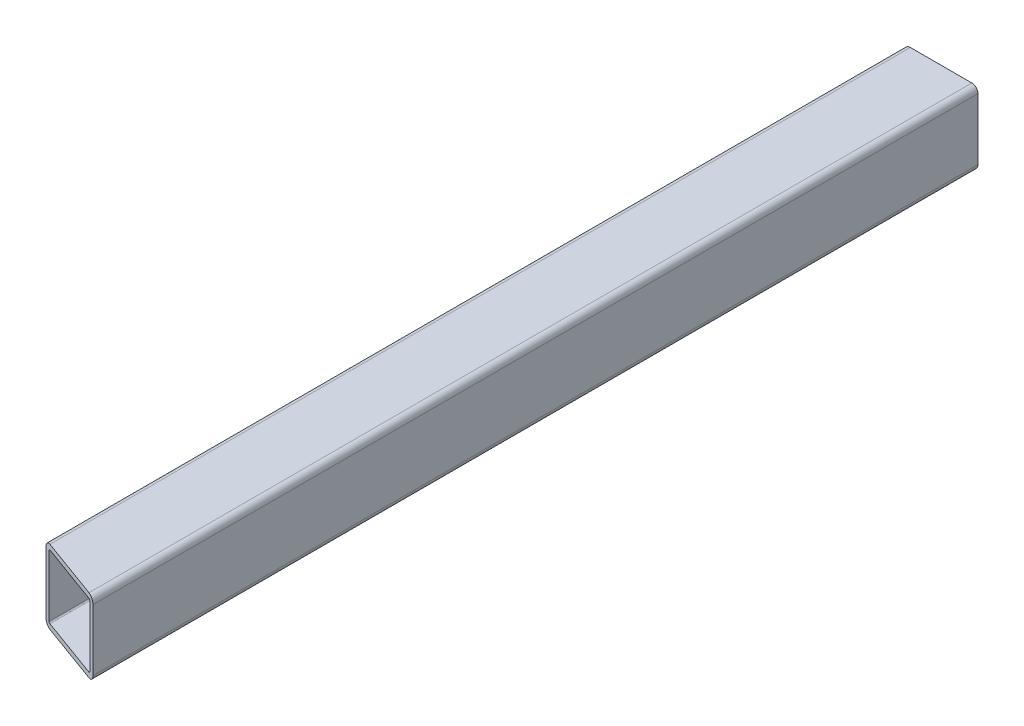
ISO-10303-21;
HEADER;
FILE_DESCRIPTION(('STEP AP214'),'2;1');
FILE_NAME('part.step','',(''),(''),'','','');
FILE_SCHEMA(('AUTOMOTIVE_DESIGN { 1 0 10303 214 1 1 1 1 }'));
ENDSEC;
DATA;
#1=APPLICATION_CONTEXT('core data for automotive mechanical design processes');
#2=APPLICATION_PROTOCOL_DEFINITION('international standard','automotive_design',2000,#1);
#3=PRODUCT_CONTEXT('',#1,'mechanical');
#4=PRODUCT('Part','Part','',(#3));
#5=PRODUCT_RELATED_PRODUCT_CATEGORY('part','',(#4));
#6=PRODUCT_DEFINITION_FORMATION('','',#4);
#7=PRODUCT_DEFINITION_CONTEXT('part definition',#1,'design');
#8=PRODUCT_DEFINITION('design','',#6,#7);
#9=PRODUCT_DEFINITION_SHAPE('','',#8);
#10=(LENGTH_UNIT() NAMED_UNIT(*) SI_UNIT(.MILLI.,.METRE.));
#11=(NAMED_UNIT(*) PLANE_ANGLE_UNIT() SI_UNIT($,.RADIAN.));
#12=(NAMED_UNIT(*) SI_UNIT($,.STERADIAN.) SOLID_ANGLE_UNIT());
#13=UNCERTAINTY_MEASURE_WITH_UNIT(LENGTH_MEASURE(1.E-05),#10,'distance_accuracy_value','');
#14=(GEOMETRIC_REPRESENTATION_CONTEXT(3) GLOBAL_UNCERTAINTY_ASSIGNED_CONTEXT((#13)) GLOBAL_UNIT_ASSIGNED_CONTEXT((#10,
#11,#12)) REPRESENTATION_CONTEXT('',''));
#15=CARTESIAN_POINT('',(0.,0.,0.));
#16=DIRECTION('',(0.,0.,1.));
#17=DIRECTION('',(1.,0.,0.));
#18=AXIS2_PLACEMENT_3D('',#15,#16,#17);
#19=CARTESIAN_POINT('',(-15.875,-15.875,228.6));
#20=DIRECTION('',(0.,0.,-1.));
#21=DIRECTION('',(-1.,0.,0.));
#22=AXIS2_PLACEMENT_3D('',#19,#20,#21);
#23=CYLINDRICAL_SURFACE('',#22,3.175);
#24=CARTESIAN_POINT('',(-15.875,-15.875,215.888339568253));
#25=DIRECTION('',(-0.34202014332567,0.,0.939692620785908));
#26=DIRECTION('',(-0.939692620785908,0.,-0.34202014332567));
#27=AXIS2_PLACEMENT_3D('',#24,#25,#26);
#28=ELLIPSE('',#27,3.37876442761102,3.175);
#29=CARTESIAN_POINT('',(-19.05,-15.875,214.732734074458));
#30=VERTEX_POINT('',#29);
#31=CARTESIAN_POINT('',(-15.875,-19.05,215.888339568253));
#32=VERTEX_POINT('',#31);
#33=EDGE_CURVE('E206',#30,#32,#28,.T.);
#34=ORIENTED_EDGE('',*,*,#33,.F.);
#35=DIRECTION('',(0.,0.,-1.));
#36=VECTOR('',#35,1.);
#37=CARTESIAN_POINT('',(-19.05,-15.875,228.6));
#38=LINE('',#37,#36);
#39=CARTESIAN_POINT('',(-19.05,-15.875,-228.6));
#40=VERTEX_POINT('',#39);
#41=EDGE_CURVE('E191',#30,#40,#38,.T.);
#42=ORIENTED_EDGE('',*,*,#41,.T.);
#43=CARTESIAN_POINT('',(-15.875,-15.875,-228.6));
#44=DIRECTION('',(0.,0.,1.));
#45=DIRECTION('',(1.,0.,0.));
#46=AXIS2_PLACEMENT_3D('',#43,#44,#45);
#47=CIRCLE('',#46,3.175);
#48=CARTESIAN_POINT('',(-15.875,-19.05,-228.6));
#49=VERTEX_POINT('',#48);
#50=EDGE_CURVE('E284',#40,#49,#47,.T.);
#51=ORIENTED_EDGE('',*,*,#50,.T.);
#52=DIRECTION('',(0.,0.,-1.));
#53=VECTOR('',#52,1.);
#54=CARTESIAN_POINT('',(-15.875,-19.05,228.6));
#55=LINE('',#54,#53);
#56=EDGE_CURVE('E87',#32,#49,#55,.T.);
#57=ORIENTED_EDGE('',*,*,#56,.F.);
#58=EDGE_LOOP('',(#34,#42,#51,#57));
#59=FACE_BOUND('',#58,.T.);
#60=ADVANCED_FACE('F80',(#59),#23,.T.);
#61=CARTESIAN_POINT('',(-15.875,-19.05,228.6));
#62=DIRECTION('',(0.,1.,0.));
#63=DIRECTION('',(0.,0.,1.));
#64=AXIS2_PLACEMENT_3D('',#61,#62,#63);
#65=PLANE('',#64);
#66=DIRECTION('',(0.939692620785908,0.,0.34202014332567));
#67=VECTOR('',#66,1.);
#68=CARTESIAN_POINT('',(-11.7895510879651,-19.05,217.375321365849));
#69=LINE('',#68,#67);
#70=CARTESIAN_POINT('',(15.875,-19.05,227.444394506205));
#71=VERTEX_POINT('',#70);
#72=EDGE_CURVE('E94',#32,#71,#69,.T.);
#73=ORIENTED_EDGE('',*,*,#72,.F.);
#74=ORIENTED_EDGE('',*,*,#56,.T.);
#75=DIRECTION('',(1.,0.,0.));
#76=VECTOR('',#75,1.);
#77=CARTESIAN_POINT('',(-15.875,-19.05,-228.6));
#78=LINE('',#77,#76);
#79=CARTESIAN_POINT('',(15.875,-19.05,-228.6));
#80=VERTEX_POINT('',#79);
#81=EDGE_CURVE('E288',#49,#80,#78,.T.);
#82=ORIENTED_EDGE('',*,*,#81,.T.);
#83=DIRECTION('',(0.,0.,-1.));
#84=VECTOR('',#83,1.);
#85=CARTESIAN_POINT('',(15.875,-19.05,228.6));
#86=LINE('',#85,#84);
#87=EDGE_CURVE('E316',#71,#80,#86,.T.);
#88=ORIENTED_EDGE('',*,*,#87,.F.);
#89=EDGE_LOOP('',(#73,#74,#82,#88));
#90=FACE_BOUND('',#89,.T.);
#91=ADVANCED_FACE('F318',(#90),#65,.F.);
#92=CARTESIAN_POINT('',(15.875,-15.875,228.6));
#93=DIRECTION('',(0.,0.,-1.));
#94=DIRECTION('',(-1.,0.,0.));
#95=AXIS2_PLACEMENT_3D('',#92,#93,#94);
#96=CYLINDRICAL_SURFACE('',#95,3.175);
#97=CARTESIAN_POINT('',(15.875,-15.875,227.444394506205));
#98=DIRECTION('',(-0.34202014332567,0.,0.939692620785908));
#99=DIRECTION('',(-0.939692620785908,0.,-0.34202014332567));
#100=AXIS2_PLACEMENT_3D('',#97,#98,#99);
#101=ELLIPSE('',#100,3.37876442761102,3.175);
#102=CARTESIAN_POINT('',(19.05,-15.875,228.6));
#103=VERTEX_POINT('',#102);
#104=EDGE_CURVE('E102',#71,#103,#101,.T.);
#105=ORIENTED_EDGE('',*,*,#104,.F.);
#106=ORIENTED_EDGE('',*,*,#87,.T.);
#107=CARTESIAN_POINT('',(15.875,-15.875,-228.6));
#108=DIRECTION('',(0.,0.,1.));
#109=DIRECTION('',(1.,0.,0.));
#110=AXIS2_PLACEMENT_3D('',#107,#108,#109);
#111=CIRCLE('',#110,3.175);
#112=CARTESIAN_POINT('',(19.05,-15.875,-228.6));
#113=VERTEX_POINT('',#112);
#114=EDGE_CURVE('E291',#80,#113,#111,.T.);
#115=ORIENTED_EDGE('',*,*,#114,.T.);
#116=DIRECTION('',(0.,0.,-1.));
#117=VECTOR('',#116,1.);
#118=CARTESIAN_POINT('',(19.05,-15.875,228.6));
#119=LINE('',#118,#117);
#120=EDGE_CURVE('E313',#103,#113,#119,.T.);
#121=ORIENTED_EDGE('',*,*,#120,.F.);
#122=EDGE_LOOP('',(#105,#106,#115,#121));
#123=FACE_BOUND('',#122,.T.);
#124=ADVANCED_FACE('F325',(#123),#96,.T.);
#125=CARTESIAN_POINT('',(15.875,15.875,228.6));
#126=DIRECTION('',(0.,0.,-1.));
#127=DIRECTION('',(-1.,0.,0.));
#128=AXIS2_PLACEMENT_3D('',#125,#126,#127);
#129=CYLINDRICAL_SURFACE('',#128,3.175);
#130=CARTESIAN_POINT('',(15.875,15.875,227.444394506205));
#131=DIRECTION('',(-0.34202014332567,0.,0.939692620785908));
#132=DIRECTION('',(-0.939692620785908,0.,-0.34202014332567));
#133=AXIS2_PLACEMENT_3D('',#130,#131,#132);
#134=ELLIPSE('',#133,3.37876442761103,3.175);
#135=CARTESIAN_POINT('',(19.05,15.875,228.6));
#136=VERTEX_POINT('',#135);
#137=CARTESIAN_POINT('',(15.875,19.05,227.444394506205));
#138=VERTEX_POINT('',#137);
#139=EDGE_CURVE('E240',#136,#138,#134,.T.);
#140=ORIENTED_EDGE('',*,*,#139,.F.);
#141=DIRECTION('',(0.,0.,-1.));
#142=VECTOR('',#141,1.);
#143=CARTESIAN_POINT('',(19.05,15.875,228.6));
#144=LINE('',#143,#142);
#145=CARTESIAN_POINT('',(19.05,15.875,-228.6));
#146=VERTEX_POINT('',#145);
#147=EDGE_CURVE('E310',#136,#146,#144,.T.);
#148=ORIENTED_EDGE('',*,*,#147,.T.);
#149=CARTESIAN_POINT('',(15.875,15.875,-228.6));
#150=DIRECTION('',(0.,0.,1.));
#151=DIRECTION('',(1.,0.,0.));
#152=AXIS2_PLACEMENT_3D('',#149,#150,#151);
#153=CIRCLE('',#152,3.175);
#154=CARTESIAN_POINT('',(15.875,19.05,-228.6));
#155=VERTEX_POINT('',#154);
#156=EDGE_CURVE('E295',#146,#155,#153,.T.);
#157=ORIENTED_EDGE('',*,*,#156,.T.);
#158=DIRECTION('',(0.,0.,-1.));
#159=VECTOR('',#158,1.);
#160=CARTESIAN_POINT('',(15.875,19.05,228.6));
#161=LINE('',#160,#159);
#162=EDGE_CURVE('E308',#138,#155,#161,.T.);
#163=ORIENTED_EDGE('',*,*,#162,.F.);
#164=EDGE_LOOP('',(#140,#148,#157,#163));
#165=FACE_BOUND('',#164,.T.);
#166=ADVANCED_FACE('F332',(#165),#129,.T.);
#167=CARTESIAN_POINT('',(-15.875,19.05,228.6));
#168=DIRECTION('',(0.,-1.,0.));
#169=DIRECTION('',(0.,0.,-1.));
#170=AXIS2_PLACEMENT_3D('',#167,#168,#169);
#171=PLANE('',#170);
#172=DIRECTION('',(-0.939692620785908,0.,-0.34202014332567));
#173=VECTOR('',#172,1.);
#174=CARTESIAN_POINT('',(-11.7895510879651,19.05,217.375321365849));
#175=LINE('',#174,#173);
#176=CARTESIAN_POINT('',(-15.875,19.05,215.888339568253));
#177=VERTEX_POINT('',#176);
#178=EDGE_CURVE('E238',#138,#177,#175,.T.);
#179=ORIENTED_EDGE('',*,*,#178,.F.);
#180=ORIENTED_EDGE('',*,*,#162,.T.);
#181=DIRECTION('',(-1.,0.,0.));
#182=VECTOR('',#181,1.);
#183=CARTESIAN_POINT('',(-15.875,19.05,-228.6));
#184=LINE('',#183,#182);
#185=CARTESIAN_POINT('',(-15.875,19.05,-228.6));
#186=VERTEX_POINT('',#185);
#187=EDGE_CURVE('E298',#155,#186,#184,.T.);
#188=ORIENTED_EDGE('',*,*,#187,.T.);
#189=DIRECTION('',(0.,0.,-1.));
#190=VECTOR('',#189,1.);
#191=CARTESIAN_POINT('',(-15.875,19.05,228.6));
#192=LINE('',#191,#190);
#193=EDGE_CURVE('E306',#177,#186,#192,.T.);
#194=ORIENTED_EDGE('',*,*,#193,.F.);
#195=EDGE_LOOP('',(#179,#180,#188,#194));
#196=FACE_BOUND('',#195,.T.);
#197=ADVANCED_FACE('F335',(#196),#171,.F.);
#198=CARTESIAN_POINT('',(-15.875,15.875,228.6));
#199=DIRECTION('',(0.,0.,-1.));
#200=DIRECTION('',(-1.,0.,0.));
#201=AXIS2_PLACEMENT_3D('',#198,#199,#200);
#202=CYLINDRICAL_SURFACE('',#201,3.175);
#203=CARTESIAN_POINT('',(-15.875,15.875,215.888339568253));
#204=DIRECTION('',(-0.34202014332567,0.,0.939692620785908));
#205=DIRECTION('',(-0.939692620785908,0.,-0.34202014332567));
#206=AXIS2_PLACEMENT_3D('',#203,#204,#205);
#207=ELLIPSE('',#206,3.37876442761103,3.175);
#208=CARTESIAN_POINT('',(-19.05,15.875,214.732734074458));
#209=VERTEX_POINT('',#208);
#210=EDGE_CURVE('E213',#177,#209,#207,.T.);
#211=ORIENTED_EDGE('',*,*,#210,.F.);
#212=ORIENTED_EDGE('',*,*,#193,.T.);
#213=CARTESIAN_POINT('',(-15.875,15.875,-228.6));
#214=DIRECTION('',(0.,0.,1.));
#215=DIRECTION('',(1.,0.,0.));
#216=AXIS2_PLACEMENT_3D('',#213,#214,#215);
#217=CIRCLE('',#216,3.175);
#218=CARTESIAN_POINT('',(-19.05,15.875,-228.6));
#219=VERTEX_POINT('',#218);
#220=EDGE_CURVE('E301',#186,#219,#217,.T.);
#221=ORIENTED_EDGE('',*,*,#220,.T.);
#222=DIRECTION('',(0.,0.,-1.));
#223=VECTOR('',#222,1.);
#224=CARTESIAN_POINT('',(-19.05,15.875,228.6));
#225=LINE('',#224,#223);
#226=EDGE_CURVE('E202',#209,#219,#225,.T.);
#227=ORIENTED_EDGE('',*,*,#226,.F.);
#228=EDGE_LOOP('',(#211,#212,#221,#227));
#229=FACE_BOUND('',#228,.T.);
#230=ADVANCED_FACE('F339',(#229),#202,.T.);
#231=CARTESIAN_POINT('',(-19.05,15.875,228.6));
#232=DIRECTION('',(1.,0.,0.));
#233=DIRECTION('',(0.,1.,0.));
#234=AXIS2_PLACEMENT_3D('',#231,#232,#233);
#235=PLANE('',#234);
#236=DIRECTION('',(0.,-1.,0.));
#237=VECTOR('',#236,1.);
#238=CARTESIAN_POINT('',(-19.05,642.130064492442,214.732734074458));
#239=LINE('',#238,#237);
#240=EDGE_CURVE('E195',#209,#30,#239,.T.);
#241=ORIENTED_EDGE('',*,*,#240,.F.);
#242=ORIENTED_EDGE('',*,*,#226,.T.);
#243=DIRECTION('',(0.,-1.,0.));
#244=VECTOR('',#243,1.);
#245=CARTESIAN_POINT('',(-19.05,15.875,-228.6));
#246=LINE('',#245,#244);
#247=EDGE_CURVE('E198',#219,#40,#246,.T.);
#248=ORIENTED_EDGE('',*,*,#247,.T.);
#249=ORIENTED_EDGE('',*,*,#41,.F.);
#250=EDGE_LOOP('',(#241,#242,#248,#249));
#251=FACE_BOUND('',#250,.T.);
#252=ADVANCED_FACE('F193',(#251),#235,.F.);
#253=CARTESIAN_POINT('',(-15.875,-15.875,228.6));
#254=DIRECTION('',(0.,0.,-1.));
#255=DIRECTION('',(-1.,0.,0.));
#256=AXIS2_PLACEMENT_3D('',#253,#254,#255);
#257=CYLINDRICAL_SURFACE('',#256,0.635000000000002);
#258=DIRECTION('',(0.,0.,-1.));
#259=VECTOR('',#258,1.);
#260=CARTESIAN_POINT('',(-16.51,-15.875,228.6));
#261=LINE('',#260,#259);
#262=CARTESIAN_POINT('',(-16.51,-15.875,215.657218469494));
#263=VERTEX_POINT('',#262);
#264=CARTESIAN_POINT('',(-16.51,-15.875,-228.6));
#265=VERTEX_POINT('',#264);
#266=EDGE_CURVE('E268',#263,#265,#261,.T.);
#267=ORIENTED_EDGE('',*,*,#266,.F.);
#268=CARTESIAN_POINT('',(-15.875,-15.875,215.888339568253));
#269=DIRECTION('',(-0.34202014332567,0.,0.939692620785908));
#270=DIRECTION('',(-0.939692620785908,0.,-0.34202014332567));
#271=AXIS2_PLACEMENT_3D('',#268,#269,#270);
#272=ELLIPSE('',#271,0.675752885522207,0.635000000000002);
#273=CARTESIAN_POINT('',(-15.875,-16.51,215.888339568253));
#274=VERTEX_POINT('',#273);
#275=EDGE_CURVE('E234',#263,#274,#272,.T.);
#276=ORIENTED_EDGE('',*,*,#275,.T.);
#277=DIRECTION('',(0.,0.,-1.));
#278=VECTOR('',#277,1.);
#279=CARTESIAN_POINT('',(-15.875,-16.51,228.6));
#280=LINE('',#279,#278);
#281=CARTESIAN_POINT('',(-15.875,-16.51,-228.6));
#282=VERTEX_POINT('',#281);
#283=EDGE_CURVE('E282',#274,#282,#280,.T.);
#284=ORIENTED_EDGE('',*,*,#283,.T.);
#285=CARTESIAN_POINT('',(-15.875,-15.875,-228.6));
#286=DIRECTION('',(0.,0.,1.));
#287=DIRECTION('',(1.,0.,0.));
#288=AXIS2_PLACEMENT_3D('',#285,#286,#287);
#289=CIRCLE('',#288,0.635000000000002);
#290=EDGE_CURVE('E208',#265,#282,#289,.T.);
#291=ORIENTED_EDGE('',*,*,#290,.F.);
#292=EDGE_LOOP('',(#267,#276,#284,#291));
#293=FACE_BOUND('',#292,.T.);
#294=ADVANCED_FACE('F346',(#293),#257,.F.);
#295=CARTESIAN_POINT('',(-15.875,-16.51,228.6));
#296=DIRECTION('',(0.,1.,0.));
#297=DIRECTION('',(0.,0.,1.));
#298=AXIS2_PLACEMENT_3D('',#295,#296,#297);
#299=PLANE('',#298);
#300=ORIENTED_EDGE('',*,*,#283,.F.);
#301=DIRECTION('',(0.939692620785908,0.,0.34202014332567));
#302=VECTOR('',#301,1.);
#303=CARTESIAN_POINT('',(-11.7895510879651,-16.51,217.375321365849));
#304=LINE('',#303,#302);
#305=CARTESIAN_POINT('',(15.875,-16.51,227.444394506205));
#306=VERTEX_POINT('',#305);
#307=EDGE_CURVE('E231',#274,#306,#304,.T.);
#308=ORIENTED_EDGE('',*,*,#307,.T.);
#309=DIRECTION('',(0.,0.,-1.));
#310=VECTOR('',#309,1.);
#311=CARTESIAN_POINT('',(15.875,-16.51,228.6));
#312=LINE('',#311,#310);
#313=CARTESIAN_POINT('',(15.875,-16.51,-228.6));
#314=VERTEX_POINT('',#313);
#315=EDGE_CURVE('E280',#306,#314,#312,.T.);
#316=ORIENTED_EDGE('',*,*,#315,.T.);
#317=DIRECTION('',(1.,0.,0.));
#318=VECTOR('',#317,1.);
#319=CARTESIAN_POINT('',(-15.875,-16.51,-228.6));
#320=LINE('',#319,#318);
#321=EDGE_CURVE('E247',#282,#314,#320,.T.);
#322=ORIENTED_EDGE('',*,*,#321,.F.);
#323=EDGE_LOOP('',(#300,#308,#316,#322));
#324=FACE_BOUND('',#323,.T.);
#325=ADVANCED_FACE('F388',(#324),#299,.T.);
#326=CARTESIAN_POINT('',(15.875,-15.875,228.6));
#327=DIRECTION('',(0.,0.,-1.));
#328=DIRECTION('',(-1.,0.,0.));
#329=AXIS2_PLACEMENT_3D('',#326,#327,#328);
#330=CYLINDRICAL_SURFACE('',#329,0.634999999999999);
#331=ORIENTED_EDGE('',*,*,#315,.F.);
#332=CARTESIAN_POINT('',(15.875,-15.875,227.444394506205));
#333=DIRECTION('',(-0.34202014332567,0.,0.939692620785908));
#334=DIRECTION('',(-0.939692620785908,0.,-0.34202014332567));
#335=AXIS2_PLACEMENT_3D('',#332,#333,#334);
#336=ELLIPSE('',#335,0.675752885522203,0.634999999999999);
#337=CARTESIAN_POINT('',(16.51,-15.875,227.675515604964));
#338=VERTEX_POINT('',#337);
#339=EDGE_CURVE('E228',#306,#338,#336,.T.);
#340=ORIENTED_EDGE('',*,*,#339,.T.);
#341=DIRECTION('',(0.,0.,-1.));
#342=VECTOR('',#341,1.);
#343=CARTESIAN_POINT('',(16.51,-15.875,228.6));
#344=LINE('',#343,#342);
#345=CARTESIAN_POINT('',(16.51,-15.875,-228.6));
#346=VERTEX_POINT('',#345);
#347=EDGE_CURVE('E278',#338,#346,#344,.T.);
#348=ORIENTED_EDGE('',*,*,#347,.T.);
#349=CARTESIAN_POINT('',(15.875,-15.875,-228.6));
#350=DIRECTION('',(0.,0.,1.));
#351=DIRECTION('',(1.,0.,0.));
#352=AXIS2_PLACEMENT_3D('',#349,#350,#351);
#353=CIRCLE('',#352,0.634999999999999);
#354=EDGE_CURVE('E250',#314,#346,#353,.T.);
#355=ORIENTED_EDGE('',*,*,#354,.F.);
#356=EDGE_LOOP('',(#331,#340,#348,#355));
#357=FACE_BOUND('',#356,.T.);
#358=ADVANCED_FACE('F398',(#357),#330,.F.);
#359=CARTESIAN_POINT('',(16.51,15.875,228.6));
#360=DIRECTION('',(-1.,0.,0.));
#361=DIRECTION('',(0.,-1.,0.));
#362=AXIS2_PLACEMENT_3D('',#359,#360,#361);
#363=PLANE('',#362);
#364=ORIENTED_EDGE('',*,*,#347,.F.);
#365=DIRECTION('',(0.,1.,0.));
#366=VECTOR('',#365,1.);
#367=CARTESIAN_POINT('',(16.51,15.875,227.675515604964));
#368=LINE('',#367,#366);
#369=CARTESIAN_POINT('',(16.51,15.875,227.675515604964));
#370=VERTEX_POINT('',#369);
#371=EDGE_CURVE('E225',#338,#370,#368,.T.);
#372=ORIENTED_EDGE('',*,*,#371,.T.);
#373=DIRECTION('',(0.,0.,-1.));
#374=VECTOR('',#373,1.);
#375=CARTESIAN_POINT('',(16.51,15.875,228.6));
#376=LINE('',#375,#374);
#377=CARTESIAN_POINT('',(16.51,15.875,-228.6));
#378=VERTEX_POINT('',#377);
#379=EDGE_CURVE('E276',#370,#378,#376,.T.);
#380=ORIENTED_EDGE('',*,*,#379,.T.);
#381=DIRECTION('',(0.,1.,0.));
#382=VECTOR('',#381,1.);
#383=CARTESIAN_POINT('',(16.51,15.875,-228.6));
#384=LINE('',#383,#382);
#385=EDGE_CURVE('E253',#346,#378,#384,.T.);
#386=ORIENTED_EDGE('',*,*,#385,.F.);
#387=EDGE_LOOP('',(#364,#372,#380,#386));
#388=FACE_BOUND('',#387,.T.);
#389=ADVANCED_FACE('F408',(#388),#363,.T.);
#390=CARTESIAN_POINT('',(15.875,15.875,228.6));
#391=DIRECTION('',(0.,0.,-1.));
#392=DIRECTION('',(-1.,0.,0.));
#393=AXIS2_PLACEMENT_3D('',#390,#391,#392);
#394=CYLINDRICAL_SURFACE('',#393,0.635000000000004);
#395=ORIENTED_EDGE('',*,*,#379,.F.);
#396=CARTESIAN_POINT('',(15.875,15.875,227.444394506205));
#397=DIRECTION('',(-0.34202014332567,0.,0.939692620785908));
#398=DIRECTION('',(-0.939692620785908,0.,-0.34202014332567));
#399=AXIS2_PLACEMENT_3D('',#396,#397,#398);
#400=ELLIPSE('',#399,0.675752885522209,0.635000000000004);
#401=CARTESIAN_POINT('',(15.875,16.51,227.444394506205));
#402=VERTEX_POINT('',#401);
#403=EDGE_CURVE('E222',#370,#402,#400,.T.);
#404=ORIENTED_EDGE('',*,*,#403,.T.);
#405=DIRECTION('',(0.,0.,-1.));
#406=VECTOR('',#405,1.);
#407=CARTESIAN_POINT('',(15.875,16.51,228.6));
#408=LINE('',#407,#406);
#409=CARTESIAN_POINT('',(15.875,16.51,-228.6));
#410=VERTEX_POINT('',#409);
#411=EDGE_CURVE('E274',#402,#410,#408,.T.);
#412=ORIENTED_EDGE('',*,*,#411,.T.);
#413=CARTESIAN_POINT('',(15.875,15.875,-228.6));
#414=DIRECTION('',(0.,0.,1.));
#415=DIRECTION('',(1.,0.,0.));
#416=AXIS2_PLACEMENT_3D('',#413,#414,#415);
#417=CIRCLE('',#416,0.635000000000004);
#418=EDGE_CURVE('E256',#378,#410,#417,.T.);
#419=ORIENTED_EDGE('',*,*,#418,.F.);
#420=EDGE_LOOP('',(#395,#404,#412,#419));
#421=FACE_BOUND('',#420,.T.);
#422=ADVANCED_FACE('F418',(#421),#394,.F.);
#423=CARTESIAN_POINT('',(-15.875,16.51,228.6));
#424=DIRECTION('',(0.,-1.,0.));
#425=DIRECTION('',(0.,0.,-1.));
#426=AXIS2_PLACEMENT_3D('',#423,#424,#425);
#427=PLANE('',#426);
#428=ORIENTED_EDGE('',*,*,#411,.F.);
#429=DIRECTION('',(-0.939692620785908,0.,-0.34202014332567));
#430=VECTOR('',#429,1.);
#431=CARTESIAN_POINT('',(-11.7895510879651,16.51,217.375321365849));
#432=LINE('',#431,#430);
#433=CARTESIAN_POINT('',(-15.875,16.51,215.888339568253));
#434=VERTEX_POINT('',#433);
#435=EDGE_CURVE('E217',#402,#434,#432,.T.);
#436=ORIENTED_EDGE('',*,*,#435,.T.);
#437=DIRECTION('',(0.,0.,-1.));
#438=VECTOR('',#437,1.);
#439=CARTESIAN_POINT('',(-15.875,16.51,228.6));
#440=LINE('',#439,#438);
#441=CARTESIAN_POINT('',(-15.875,16.51,-228.6));
#442=VERTEX_POINT('',#441);
#443=EDGE_CURVE('E272',#434,#442,#440,.T.);
#444=ORIENTED_EDGE('',*,*,#443,.T.);
#445=DIRECTION('',(-1.,0.,0.));
#446=VECTOR('',#445,1.);
#447=CARTESIAN_POINT('',(-15.875,16.51,-228.6));
#448=LINE('',#447,#446);
#449=EDGE_CURVE('E259',#410,#442,#448,.T.);
#450=ORIENTED_EDGE('',*,*,#449,.F.);
#451=EDGE_LOOP('',(#428,#436,#444,#450));
#452=FACE_BOUND('',#451,.T.);
#453=ADVANCED_FACE('F428',(#452),#427,.T.);
#454=CARTESIAN_POINT('',(-15.875,15.875,228.6));
#455=DIRECTION('',(0.,0.,-1.));
#456=DIRECTION('',(-1.,0.,0.));
#457=AXIS2_PLACEMENT_3D('',#454,#455,#456);
#458=CYLINDRICAL_SURFACE('',#457,0.635000000000004);
#459=ORIENTED_EDGE('',*,*,#443,.F.);
#460=CARTESIAN_POINT('',(-15.875,15.875,215.888339568253));
#461=DIRECTION('',(-0.34202014332567,0.,0.939692620785908));
#462=DIRECTION('',(-0.939692620785908,0.,-0.34202014332567));
#463=AXIS2_PLACEMENT_3D('',#460,#461,#462);
#464=ELLIPSE('',#463,0.675752885522209,0.635000000000004);
#465=CARTESIAN_POINT('',(-16.51,15.875,215.657218469494));
#466=VERTEX_POINT('',#465);
#467=EDGE_CURVE('E214',#434,#466,#464,.T.);
#468=ORIENTED_EDGE('',*,*,#467,.T.);
#469=DIRECTION('',(0.,0.,-1.));
#470=VECTOR('',#469,1.);
#471=CARTESIAN_POINT('',(-16.51,15.875,228.6));
#472=LINE('',#471,#470);
#473=CARTESIAN_POINT('',(-16.51,15.875,-228.6));
#474=VERTEX_POINT('',#473);
#475=EDGE_CURVE('E270',#466,#474,#472,.T.);
#476=ORIENTED_EDGE('',*,*,#475,.T.);
#477=CARTESIAN_POINT('',(-15.875,15.875,-228.6));
#478=DIRECTION('',(0.,0.,1.));
#479=DIRECTION('',(1.,0.,0.));
#480=AXIS2_PLACEMENT_3D('',#477,#478,#479);
#481=CIRCLE('',#480,0.635000000000004);
#482=EDGE_CURVE('E262',#442,#474,#481,.T.);
#483=ORIENTED_EDGE('',*,*,#482,.F.);
#484=EDGE_LOOP('',(#459,#468,#476,#483));
#485=FACE_BOUND('',#484,.T.);
#486=ADVANCED_FACE('F438',(#485),#458,.F.);
#487=CARTESIAN_POINT('',(-16.51,15.875,228.6));
#488=DIRECTION('',(1.,0.,0.));
#489=DIRECTION('',(0.,1.,0.));
#490=AXIS2_PLACEMENT_3D('',#487,#488,#489);
#491=PLANE('',#490);
#492=ORIENTED_EDGE('',*,*,#475,.F.);
#493=DIRECTION('',(0.,-1.,0.));
#494=VECTOR('',#493,1.);
#495=CARTESIAN_POINT('',(-16.51,15.875,215.657218469494));
#496=LINE('',#495,#494);
#497=EDGE_CURVE('E12',#466,#263,#496,.T.);
#498=ORIENTED_EDGE('',*,*,#497,.T.);
#499=ORIENTED_EDGE('',*,*,#266,.T.);
#500=DIRECTION('',(0.,-1.,0.));
#501=VECTOR('',#500,1.);
#502=CARTESIAN_POINT('',(-16.51,15.875,-228.6));
#503=LINE('',#502,#501);
#504=EDGE_CURVE('E265',#474,#265,#503,.T.);
#505=ORIENTED_EDGE('',*,*,#504,.F.);
#506=EDGE_LOOP('',(#492,#498,#499,#505));
#507=FACE_BOUND('',#506,.T.);
#508=ADVANCED_FACE('F448',(#507),#491,.T.);
#509=CARTESIAN_POINT('',(-15.875,-15.875,-228.6));
#510=DIRECTION('',(0.,0.,1.));
#511=DIRECTION('',(1.,0.,0.));
#512=AXIS2_PLACEMENT_3D('',#509,#510,#511);
#513=PLANE('',#512);
#514=ORIENTED_EDGE('',*,*,#50,.F.);
#515=ORIENTED_EDGE('',*,*,#247,.F.);
#516=ORIENTED_EDGE('',*,*,#220,.F.);
#517=ORIENTED_EDGE('',*,*,#187,.F.);
#518=ORIENTED_EDGE('',*,*,#156,.F.);
#519=DIRECTION('',(0.,1.,0.));
#520=VECTOR('',#519,1.);
#521=CARTESIAN_POINT('',(19.05,15.875,-228.6));
#522=LINE('',#521,#520);
#523=EDGE_CURVE('E293',#113,#146,#522,.T.);
#524=ORIENTED_EDGE('',*,*,#523,.F.);
#525=ORIENTED_EDGE('',*,*,#114,.F.);
#526=ORIENTED_EDGE('',*,*,#81,.F.);
#527=EDGE_LOOP('',(#514,#515,#516,#517,#518,#524,#525,#526));
#528=FACE_BOUND('',#527,.T.);
#529=ORIENTED_EDGE('',*,*,#290,.T.);
#530=ORIENTED_EDGE('',*,*,#321,.T.);
#531=ORIENTED_EDGE('',*,*,#354,.T.);
#532=ORIENTED_EDGE('',*,*,#385,.T.);
#533=ORIENTED_EDGE('',*,*,#418,.T.);
#534=ORIENTED_EDGE('',*,*,#449,.T.);
#535=ORIENTED_EDGE('',*,*,#482,.T.);
#536=ORIENTED_EDGE('',*,*,#504,.T.);
#537=EDGE_LOOP('',(#529,#530,#531,#532,#533,#534,#535,#536));
#538=FACE_BOUND('',#537,.T.);
#539=ADVANCED_FACE('F321',(#528,#538),#513,.F.);
#540=CARTESIAN_POINT('',(19.05,15.875,228.6));
#541=DIRECTION('',(-1.,0.,0.));
#542=DIRECTION('',(0.,-1.,0.));
#543=AXIS2_PLACEMENT_3D('',#540,#541,#542);
#544=PLANE('',#543);
#545=ORIENTED_EDGE('',*,*,#523,.T.);
#546=ORIENTED_EDGE('',*,*,#147,.F.);
#547=DIRECTION('',(0.,1.,0.));
#548=VECTOR('',#547,1.);
#549=CARTESIAN_POINT('',(19.05,15.875,228.6));
#550=LINE('',#549,#548);
#551=EDGE_CURVE('E203',#103,#136,#550,.T.);
#552=ORIENTED_EDGE('',*,*,#551,.F.);
#553=ORIENTED_EDGE('',*,*,#120,.T.);
#554=EDGE_LOOP('',(#545,#546,#552,#553));
#555=FACE_BOUND('',#554,.T.);
#556=ADVANCED_FACE('F328',(#555),#544,.F.);
#557=CARTESIAN_POINT('',(19.05,642.130064492442,228.6));
#558=DIRECTION('',(-0.34202014332567,0.,0.939692620785908));
#559=DIRECTION('',(0.939692620785908,0.,0.34202014332567));
#560=AXIS2_PLACEMENT_3D('',#557,#558,#559);
#561=PLANE('',#560);
#562=ORIENTED_EDGE('',*,*,#275,.F.);
#563=ORIENTED_EDGE('',*,*,#497,.F.);
#564=ORIENTED_EDGE('',*,*,#467,.F.);
#565=ORIENTED_EDGE('',*,*,#435,.F.);
#566=ORIENTED_EDGE('',*,*,#403,.F.);
#567=ORIENTED_EDGE('',*,*,#371,.F.);
#568=ORIENTED_EDGE('',*,*,#339,.F.);
#569=ORIENTED_EDGE('',*,*,#307,.F.);
#570=EDGE_LOOP('',(#562,#563,#564,#565,#566,#567,#568,#569));
#571=FACE_BOUND('',#570,.T.);
#572=ORIENTED_EDGE('',*,*,#240,.T.);
#573=ORIENTED_EDGE('',*,*,#33,.T.);
#574=ORIENTED_EDGE('',*,*,#72,.T.);
#575=ORIENTED_EDGE('',*,*,#104,.T.);
#576=ORIENTED_EDGE('',*,*,#551,.T.);
#577=ORIENTED_EDGE('',*,*,#139,.T.);
#578=ORIENTED_EDGE('',*,*,#178,.T.);
#579=ORIENTED_EDGE('',*,*,#210,.T.);
#580=EDGE_LOOP('',(#572,#573,#574,#575,#576,#577,#578,#579));
#581=FACE_BOUND('',#580,.T.);
#582=ADVANCED_FACE('F211',(#571,#581),#561,.T.);
#583=CLOSED_SHELL('',(#60,#91,#124,#166,#197,#230,#252,#294,#325,#358,#389,#422,#453,#486,#508,
#539,#556,#582));
#584=MANIFOLD_SOLID_BREP('B2',#583);
#585=ADVANCED_BREP_SHAPE_REPRESENTATION('',(#18,#584),#14);
#586=SHAPE_DEFINITION_REPRESENTATION(#9,#585);
ENDSEC;
END-ISO-10303-21;
